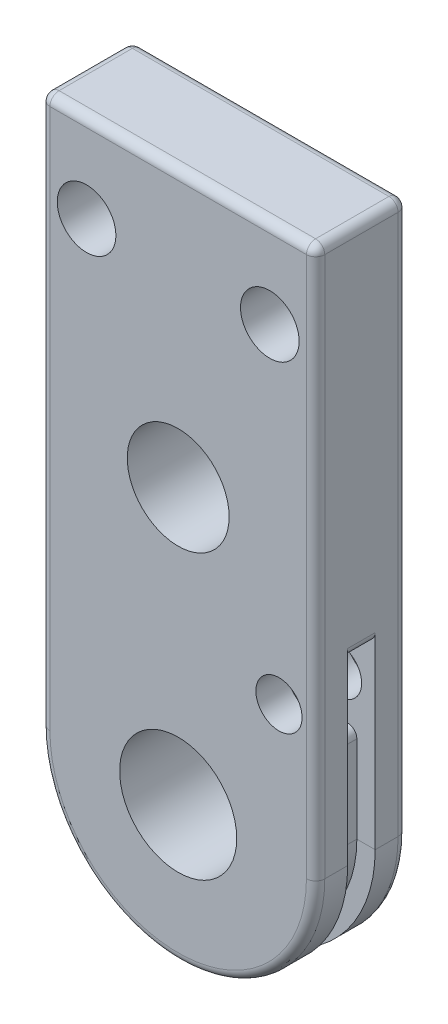
ISO-10303-21;
HEADER;
FILE_DESCRIPTION(('STEP AP214'),'2;1');
FILE_NAME('part.step','',(''),(''),'','','');
FILE_SCHEMA(('AUTOMOTIVE_DESIGN { 1 0 10303 214 1 1 1 1 }'));
ENDSEC;
DATA;
#1=APPLICATION_CONTEXT('core data for automotive mechanical design processes');
#2=APPLICATION_PROTOCOL_DEFINITION('international standard','automotive_design',2000,#1);
#3=PRODUCT_CONTEXT('',#1,'mechanical');
#4=PRODUCT('Part','Part','',(#3));
#5=PRODUCT_RELATED_PRODUCT_CATEGORY('part','',(#4));
#6=PRODUCT_DEFINITION_FORMATION('','',#4);
#7=PRODUCT_DEFINITION_CONTEXT('part definition',#1,'design');
#8=PRODUCT_DEFINITION('design','',#6,#7);
#9=PRODUCT_DEFINITION_SHAPE('','',#8);
#10=(LENGTH_UNIT() NAMED_UNIT(*) SI_UNIT(.MILLI.,.METRE.));
#11=(NAMED_UNIT(*) PLANE_ANGLE_UNIT() SI_UNIT($,.RADIAN.));
#12=(NAMED_UNIT(*) SI_UNIT($,.STERADIAN.) SOLID_ANGLE_UNIT());
#13=UNCERTAINTY_MEASURE_WITH_UNIT(LENGTH_MEASURE(1.E-05),#10,'distance_accuracy_value','');
#14=(GEOMETRIC_REPRESENTATION_CONTEXT(3) GLOBAL_UNCERTAINTY_ASSIGNED_CONTEXT((#13)) GLOBAL_UNIT_ASSIGNED_CONTEXT((#10,
#11,#12)) REPRESENTATION_CONTEXT('',''));
#15=CARTESIAN_POINT('',(0.,0.,0.));
#16=DIRECTION('',(0.,0.,1.));
#17=DIRECTION('',(1.,0.,0.));
#18=AXIS2_PLACEMENT_3D('',#15,#16,#17);
#19=CARTESIAN_POINT('',(0.,0.,3.175));
#20=DIRECTION('',(0.,0.,-1.));
#21=DIRECTION('',(-1.,0.,0.));
#22=AXIS2_PLACEMENT_3D('',#19,#20,#21);
#23=CYLINDRICAL_SURFACE('',#22,9.52500000000001);
#24=DIRECTION('',(0.,0.,-1.));
#25=VECTOR('',#24,1.);
#26=CARTESIAN_POINT('',(9.52500000000002,0.,3.175));
#27=LINE('',#26,#25);
#28=CARTESIAN_POINT('',(9.52500000000002,0.,2.54));
#29=VERTEX_POINT('',#28);
#30=CARTESIAN_POINT('',(9.52500000000001,0.,0.9525));
#31=VERTEX_POINT('',#30);
#32=EDGE_CURVE('E324',#29,#31,#27,.T.);
#33=ORIENTED_EDGE('',*,*,#32,.F.);
#34=CARTESIAN_POINT('',(0.,0.,2.54));
#35=DIRECTION('',(0.,0.,1.));
#36=DIRECTION('',(1.,0.,0.));
#37=AXIS2_PLACEMENT_3D('',#34,#35,#36);
#38=CIRCLE('',#37,9.52500000000001);
#39=CARTESIAN_POINT('',(-9.525,0.,2.54));
#40=VERTEX_POINT('',#39);
#41=EDGE_CURVE('E368',#29,#40,#38,.F.);
#42=ORIENTED_EDGE('',*,*,#41,.T.);
#43=DIRECTION('',(0.,0.,-1.));
#44=VECTOR('',#43,1.);
#45=CARTESIAN_POINT('',(-9.525,0.,3.175));
#46=LINE('',#45,#44);
#47=CARTESIAN_POINT('',(-9.52500000000001,0.,0.9525));
#48=VERTEX_POINT('',#47);
#49=EDGE_CURVE('E321',#40,#48,#46,.T.);
#50=ORIENTED_EDGE('',*,*,#49,.T.);
#51=CARTESIAN_POINT('',(0.,0.,0.9525));
#52=DIRECTION('',(0.,0.,1.));
#53=DIRECTION('',(-1.,0.,0.));
#54=AXIS2_PLACEMENT_3D('',#51,#52,#53);
#55=CIRCLE('',#54,9.52500000000001);
#56=EDGE_CURVE('E251',#48,#31,#55,.T.);
#57=ORIENTED_EDGE('',*,*,#56,.T.);
#58=EDGE_LOOP('',(#33,#42,#50,#57));
#59=FACE_BOUND('',#58,.T.);
#60=ADVANCED_FACE('F40',(#59),#23,.T.);
#61=CARTESIAN_POINT('',(9.52500000000002,0.,3.175));
#62=DIRECTION('',(1.,0.,0.));
#63=DIRECTION('',(0.,1.,0.));
#64=AXIS2_PLACEMENT_3D('',#61,#62,#63);
#65=PLANE('',#64);
#66=DIRECTION('',(0.,-1.,0.));
#67=VECTOR('',#66,1.);
#68=CARTESIAN_POINT('',(9.52500000000002,0.,0.9525));
#69=LINE('',#68,#67);
#70=CARTESIAN_POINT('',(9.52500000000001,13.0302,0.9525));
#71=VERTEX_POINT('',#70);
#72=EDGE_CURVE('E262',#71,#31,#69,.T.);
#73=ORIENTED_EDGE('',*,*,#72,.F.);
#74=DIRECTION('',(0.,0.,1.));
#75=VECTOR('',#74,1.);
#76=CARTESIAN_POINT('',(9.52500000000001,13.0302,3.175));
#77=LINE('',#76,#75);
#78=CARTESIAN_POINT('',(9.52500000000001,13.0302,-0.9525));
#79=VERTEX_POINT('',#78);
#80=EDGE_CURVE('E427',#71,#79,#77,.F.);
#81=ORIENTED_EDGE('',*,*,#80,.T.);
#82=DIRECTION('',(0.,-1.,0.));
#83=VECTOR('',#82,1.);
#84=CARTESIAN_POINT('',(9.52500000000002,0.,-0.9525));
#85=LINE('',#84,#83);
#86=CARTESIAN_POINT('',(9.52500000000001,0.,-0.952500000000001));
#87=VERTEX_POINT('',#86);
#88=EDGE_CURVE('E271',#79,#87,#85,.T.);
#89=ORIENTED_EDGE('',*,*,#88,.T.);
#90=CARTESIAN_POINT('',(9.52500000000002,0.,-2.54));
#91=VERTEX_POINT('',#90);
#92=EDGE_CURVE('E323',#87,#91,#27,.T.);
#93=ORIENTED_EDGE('',*,*,#92,.T.);
#94=DIRECTION('',(0.,-1.,0.));
#95=VECTOR('',#94,1.);
#96=CARTESIAN_POINT('',(9.52499999999999,38.1,-2.54));
#97=LINE('',#96,#95);
#98=CARTESIAN_POINT('',(9.52499999999999,37.465,-2.54));
#99=VERTEX_POINT('',#98);
#100=EDGE_CURVE('E357',#91,#99,#97,.F.);
#101=ORIENTED_EDGE('',*,*,#100,.T.);
#102=DIRECTION('',(0.,0.,-1.));
#103=VECTOR('',#102,1.);
#104=CARTESIAN_POINT('',(9.52499999999999,37.465,3.175));
#105=LINE('',#104,#103);
#106=CARTESIAN_POINT('',(9.52499999999999,37.465,2.54));
#107=VERTEX_POINT('',#106);
#108=EDGE_CURVE('E355',#99,#107,#105,.F.);
#109=ORIENTED_EDGE('',*,*,#108,.T.);
#110=DIRECTION('',(0.,-1.,0.));
#111=VECTOR('',#110,1.);
#112=CARTESIAN_POINT('',(9.52500000000002,0.,2.54));
#113=LINE('',#112,#111);
#114=EDGE_CURVE('E353',#107,#29,#113,.T.);
#115=ORIENTED_EDGE('',*,*,#114,.T.);
#116=ORIENTED_EDGE('',*,*,#32,.T.);
#117=EDGE_LOOP('',(#73,#81,#89,#93,#101,#109,#115,#116));
#118=FACE_BOUND('',#117,.T.);
#119=ADVANCED_FACE('F482',(#118),#65,.T.);
#120=CARTESIAN_POINT('',(6.98500000000001,9.525,3.175));
#121=DIRECTION('',(0.,0.,-1.));
#122=DIRECTION('',(-1.,0.,0.));
#123=AXIS2_PLACEMENT_3D('',#120,#121,#122);
#124=CYLINDRICAL_SURFACE('',#123,1.6002);
#125=CARTESIAN_POINT('',(6.98500000000001,9.525,-3.175));
#126=DIRECTION('',(0.,0.,1.));
#127=DIRECTION('',(1.,0.,0.));
#128=AXIS2_PLACEMENT_3D('',#125,#126,#127);
#129=CIRCLE('',#128,1.6002);
#130=CARTESIAN_POINT('',(8.58520000000001,9.525,-3.175));
#131=VERTEX_POINT('',#130);
#132=EDGE_CURVE('E295',#131,#131,#129,.T.);
#133=ORIENTED_EDGE('',*,*,#132,.F.);
#134=EDGE_LOOP('',(#133));
#135=FACE_BOUND('',#134,.T.);
#136=CARTESIAN_POINT('',(6.98500000000001,9.525,-0.9525));
#137=DIRECTION('',(0.,0.,1.));
#138=DIRECTION('',(1.,0.,0.));
#139=AXIS2_PLACEMENT_3D('',#136,#137,#138);
#140=CIRCLE('',#139,1.6002);
#141=CARTESIAN_POINT('',(8.58520000000001,9.525,-0.9525));
#142=VERTEX_POINT('',#141);
#143=EDGE_CURVE('E258',#142,#142,#140,.T.);
#144=ORIENTED_EDGE('',*,*,#143,.T.);
#145=EDGE_LOOP('',(#144));
#146=FACE_BOUND('',#145,.T.);
#147=ADVANCED_FACE('F548',(#135,#146),#124,.F.);
#148=CARTESIAN_POINT('',(-9.52500000000001,0.,-0.9525));
#149=VERTEX_POINT('',#148);
#150=CARTESIAN_POINT('',(-9.525,0.,-2.54));
#151=VERTEX_POINT('',#150);
#152=EDGE_CURVE('E307',#149,#151,#46,.T.);
#153=ORIENTED_EDGE('',*,*,#152,.T.);
#154=CARTESIAN_POINT('',(0.,0.,-2.54));
#155=DIRECTION('',(0.,0.,1.));
#156=DIRECTION('',(1.,0.,0.));
#157=AXIS2_PLACEMENT_3D('',#154,#155,#156);
#158=CIRCLE('',#157,9.52500000000001);
#159=EDGE_CURVE('E342',#151,#91,#158,.T.);
#160=ORIENTED_EDGE('',*,*,#159,.T.);
#161=ORIENTED_EDGE('',*,*,#92,.F.);
#162=CARTESIAN_POINT('',(0.,0.,-0.9525));
#163=DIRECTION('',(0.,0.,1.));
#164=DIRECTION('',(-1.,0.,0.));
#165=AXIS2_PLACEMENT_3D('',#162,#163,#164);
#166=CIRCLE('',#165,9.52500000000001);
#167=EDGE_CURVE('E254',#149,#87,#166,.T.);
#168=ORIENTED_EDGE('',*,*,#167,.F.);
#169=EDGE_LOOP('',(#153,#160,#161,#168));
#170=FACE_BOUND('',#169,.T.);
#171=ADVANCED_FACE('F476',(#170),#23,.T.);
#172=CARTESIAN_POINT('',(0.,38.1,3.175));
#173=DIRECTION('',(0.,1.,0.));
#174=DIRECTION('',(-1.,0.,0.));
#175=AXIS2_PLACEMENT_3D('',#172,#173,#174);
#176=PLANE('',#175);
#177=DIRECTION('',(1.,0.,0.));
#178=VECTOR('',#177,1.);
#179=CARTESIAN_POINT('',(0.,38.1,2.54));
#180=LINE('',#179,#178);
#181=CARTESIAN_POINT('',(-8.89,38.1,2.54));
#182=VERTEX_POINT('',#181);
#183=CARTESIAN_POINT('',(8.88999999999999,38.1,2.54));
#184=VERTEX_POINT('',#183);
#185=EDGE_CURVE('E348',#182,#184,#180,.T.);
#186=ORIENTED_EDGE('',*,*,#185,.T.);
#187=DIRECTION('',(0.,0.,-1.));
#188=VECTOR('',#187,1.);
#189=CARTESIAN_POINT('',(8.88999999999999,38.1,3.175));
#190=LINE('',#189,#188);
#191=CARTESIAN_POINT('',(8.88999999999999,38.1,-2.54));
#192=VERTEX_POINT('',#191);
#193=EDGE_CURVE('E350',#184,#192,#190,.T.);
#194=ORIENTED_EDGE('',*,*,#193,.T.);
#195=DIRECTION('',(1.,0.,0.));
#196=VECTOR('',#195,1.);
#197=CARTESIAN_POINT('',(-9.525,38.1,-2.54));
#198=LINE('',#197,#196);
#199=CARTESIAN_POINT('',(-8.89,38.1,-2.54));
#200=VERTEX_POINT('',#199);
#201=EDGE_CURVE('E344',#192,#200,#198,.F.);
#202=ORIENTED_EDGE('',*,*,#201,.T.);
#203=DIRECTION('',(0.,0.,-1.));
#204=VECTOR('',#203,1.);
#205=CARTESIAN_POINT('',(-8.89,38.1,3.175));
#206=LINE('',#205,#204);
#207=EDGE_CURVE('E346',#200,#182,#206,.F.);
#208=ORIENTED_EDGE('',*,*,#207,.T.);
#209=EDGE_LOOP('',(#186,#194,#202,#208));
#210=FACE_BOUND('',#209,.T.);
#211=ADVANCED_FACE('F509',(#210),#176,.T.);
#212=CARTESIAN_POINT('',(0.,0.,3.175));
#213=DIRECTION('',(0.,0.,-1.));
#214=DIRECTION('',(-1.,0.,0.));
#215=AXIS2_PLACEMENT_3D('',#212,#213,#214);
#216=CYLINDRICAL_SURFACE('',#215,4.05765);
#217=CARTESIAN_POINT('',(0.,0.,3.175));
#218=DIRECTION('',(0.,0.,1.));
#219=DIRECTION('',(1.,0.,0.));
#220=AXIS2_PLACEMENT_3D('',#217,#218,#219);
#221=CIRCLE('',#220,4.05765);
#222=CARTESIAN_POINT('',(4.05765,0.,3.175));
#223=VERTEX_POINT('',#222);
#224=EDGE_CURVE('E301',#223,#223,#221,.T.);
#225=ORIENTED_EDGE('',*,*,#224,.T.);
#226=EDGE_LOOP('',(#225));
#227=FACE_BOUND('',#226,.T.);
#228=CARTESIAN_POINT('',(0.,0.,-3.175));
#229=DIRECTION('',(0.,0.,1.));
#230=DIRECTION('',(1.,0.,0.));
#231=AXIS2_PLACEMENT_3D('',#228,#229,#230);
#232=CIRCLE('',#231,4.05765);
#233=CARTESIAN_POINT('',(4.05765,0.,-3.175));
#234=VERTEX_POINT('',#233);
#235=EDGE_CURVE('E316',#234,#234,#232,.T.);
#236=ORIENTED_EDGE('',*,*,#235,.F.);
#237=EDGE_LOOP('',(#236));
#238=FACE_BOUND('',#237,.T.);
#239=ADVANCED_FACE('F556',(#227,#238),#216,.F.);
#240=CARTESIAN_POINT('',(0.,19.05,3.175));
#241=DIRECTION('',(0.,0.,-1.));
#242=DIRECTION('',(-1.,0.,0.));
#243=AXIS2_PLACEMENT_3D('',#240,#241,#242);
#244=CYLINDRICAL_SURFACE('',#243,3.5306);
#245=CARTESIAN_POINT('',(0.,19.05,3.175));
#246=DIRECTION('',(0.,0.,1.));
#247=DIRECTION('',(1.,0.,0.));
#248=AXIS2_PLACEMENT_3D('',#245,#246,#247);
#249=CIRCLE('',#248,3.5306);
#250=CARTESIAN_POINT('',(3.5306,19.05,3.175));
#251=VERTEX_POINT('',#250);
#252=EDGE_CURVE('E298',#251,#251,#249,.T.);
#253=ORIENTED_EDGE('',*,*,#252,.T.);
#254=EDGE_LOOP('',(#253));
#255=FACE_BOUND('',#254,.T.);
#256=CARTESIAN_POINT('',(0.,19.05,-3.175));
#257=DIRECTION('',(0.,0.,1.));
#258=DIRECTION('',(1.,0.,0.));
#259=AXIS2_PLACEMENT_3D('',#256,#257,#258);
#260=CIRCLE('',#259,3.5306);
#261=CARTESIAN_POINT('',(3.5306,19.05,-3.175));
#262=VERTEX_POINT('',#261);
#263=EDGE_CURVE('E313',#262,#262,#260,.T.);
#264=ORIENTED_EDGE('',*,*,#263,.F.);
#265=EDGE_LOOP('',(#264));
#266=FACE_BOUND('',#265,.T.);
#267=ADVANCED_FACE('F743',(#255,#266),#244,.F.);
#268=CARTESIAN_POINT('',(6.35,32.004,3.175));
#269=DIRECTION('',(0.,0.,-1.));
#270=DIRECTION('',(-1.,0.,0.));
#271=AXIS2_PLACEMENT_3D('',#268,#269,#270);
#272=CYLINDRICAL_SURFACE('',#271,2.032);
#273=CARTESIAN_POINT('',(6.35,32.004,3.175));
#274=DIRECTION('',(0.,0.,1.));
#275=DIRECTION('',(1.,0.,0.));
#276=AXIS2_PLACEMENT_3D('',#273,#274,#275);
#277=CIRCLE('',#276,2.032);
#278=CARTESIAN_POINT('',(8.382,32.004,3.175));
#279=VERTEX_POINT('',#278);
#280=EDGE_CURVE('E294',#279,#279,#277,.T.);
#281=ORIENTED_EDGE('',*,*,#280,.T.);
#282=EDGE_LOOP('',(#281));
#283=FACE_BOUND('',#282,.T.);
#284=CARTESIAN_POINT('',(6.35,32.004,-3.175));
#285=DIRECTION('',(0.,0.,1.));
#286=DIRECTION('',(1.,0.,0.));
#287=AXIS2_PLACEMENT_3D('',#284,#285,#286);
#288=CIRCLE('',#287,2.032);
#289=CARTESIAN_POINT('',(8.382,32.004,-3.175));
#290=VERTEX_POINT('',#289);
#291=EDGE_CURVE('E310',#290,#290,#288,.T.);
#292=ORIENTED_EDGE('',*,*,#291,.F.);
#293=EDGE_LOOP('',(#292));
#294=FACE_BOUND('',#293,.T.);
#295=ADVANCED_FACE('F736',(#283,#294),#272,.F.);
#296=CARTESIAN_POINT('',(-6.35,32.004,3.175));
#297=DIRECTION('',(0.,0.,-1.));
#298=DIRECTION('',(-1.,0.,0.));
#299=AXIS2_PLACEMENT_3D('',#296,#297,#298);
#300=CYLINDRICAL_SURFACE('',#299,2.032);
#301=CARTESIAN_POINT('',(-6.35,32.004,3.175));
#302=DIRECTION('',(0.,0.,1.));
#303=DIRECTION('',(1.,0.,0.));
#304=AXIS2_PLACEMENT_3D('',#301,#302,#303);
#305=CIRCLE('',#304,2.032);
#306=CARTESIAN_POINT('',(-4.318,32.004,3.175));
#307=VERTEX_POINT('',#306);
#308=EDGE_CURVE('E291',#307,#307,#305,.T.);
#309=ORIENTED_EDGE('',*,*,#308,.T.);
#310=EDGE_LOOP('',(#309));
#311=FACE_BOUND('',#310,.T.);
#312=CARTESIAN_POINT('',(-6.35,32.004,-3.175));
#313=DIRECTION('',(0.,0.,1.));
#314=DIRECTION('',(1.,0.,0.));
#315=AXIS2_PLACEMENT_3D('',#312,#313,#314);
#316=CIRCLE('',#315,2.032);
#317=CARTESIAN_POINT('',(-4.318,32.004,-3.175));
#318=VERTEX_POINT('',#317);
#319=EDGE_CURVE('E289',#318,#318,#316,.T.);
#320=ORIENTED_EDGE('',*,*,#319,.F.);
#321=EDGE_LOOP('',(#320));
#322=FACE_BOUND('',#321,.T.);
#323=ADVANCED_FACE('F576',(#311,#322),#300,.F.);
#324=CARTESIAN_POINT('',(-9.525,0.,3.175));
#325=DIRECTION('',(-1.,0.,0.));
#326=DIRECTION('',(0.,0.,1.));
#327=AXIS2_PLACEMENT_3D('',#324,#325,#326);
#328=PLANE('',#327);
#329=DIRECTION('',(0.,-1.,0.));
#330=VECTOR('',#329,1.);
#331=CARTESIAN_POINT('',(-9.525,6.35,-0.9525));
#332=LINE('',#331,#330);
#333=CARTESIAN_POINT('',(-9.525,6.985,-0.9525));
#334=VERTEX_POINT('',#333);
#335=EDGE_CURVE('E56',#334,#149,#332,.T.);
#336=ORIENTED_EDGE('',*,*,#335,.F.);
#337=DIRECTION('',(0.,0.,-1.));
#338=VECTOR('',#337,1.);
#339=CARTESIAN_POINT('',(-9.525,6.985,0.9525));
#340=LINE('',#339,#338);
#341=CARTESIAN_POINT('',(-9.525,6.985,0.9525));
#342=VERTEX_POINT('',#341);
#343=EDGE_CURVE('E430',#334,#342,#340,.F.);
#344=ORIENTED_EDGE('',*,*,#343,.T.);
#345=DIRECTION('',(0.,-1.,0.));
#346=VECTOR('',#345,1.);
#347=CARTESIAN_POINT('',(-9.525,6.35,0.9525));
#348=LINE('',#347,#346);
#349=EDGE_CURVE('E63',#342,#48,#348,.T.);
#350=ORIENTED_EDGE('',*,*,#349,.T.);
#351=ORIENTED_EDGE('',*,*,#49,.F.);
#352=DIRECTION('',(0.,1.,0.));
#353=VECTOR('',#352,1.);
#354=CARTESIAN_POINT('',(-9.525,0.,2.54));
#355=LINE('',#354,#353);
#356=CARTESIAN_POINT('',(-9.525,37.465,2.54));
#357=VERTEX_POINT('',#356);
#358=EDGE_CURVE('E335',#40,#357,#355,.T.);
#359=ORIENTED_EDGE('',*,*,#358,.T.);
#360=DIRECTION('',(0.,0.,-1.));
#361=VECTOR('',#360,1.);
#362=CARTESIAN_POINT('',(-9.525,37.465,3.175));
#363=LINE('',#362,#361);
#364=CARTESIAN_POINT('',(-9.525,37.465,-2.54));
#365=VERTEX_POINT('',#364);
#366=EDGE_CURVE('E337',#357,#365,#363,.T.);
#367=ORIENTED_EDGE('',*,*,#366,.T.);
#368=DIRECTION('',(0.,1.,0.));
#369=VECTOR('',#368,1.);
#370=CARTESIAN_POINT('',(-9.525,0.,-2.54));
#371=LINE('',#370,#369);
#372=EDGE_CURVE('E339',#365,#151,#371,.F.);
#373=ORIENTED_EDGE('',*,*,#372,.T.);
#374=ORIENTED_EDGE('',*,*,#152,.F.);
#375=EDGE_LOOP('',(#336,#344,#350,#351,#359,#367,#373,#374));
#376=FACE_BOUND('',#375,.T.);
#377=ADVANCED_FACE('F448',(#376),#328,.T.);
#378=CARTESIAN_POINT('',(6.98500000000001,9.525,0.9525));
#379=DIRECTION('',(0.,0.,1.));
#380=DIRECTION('',(1.,0.,0.));
#381=AXIS2_PLACEMENT_3D('',#378,#379,#380);
#382=CIRCLE('',#381,1.6002);
#383=CARTESIAN_POINT('',(8.58520000000001,9.525,0.9525));
#384=VERTEX_POINT('',#383);
#385=EDGE_CURVE('E243',#384,#384,#382,.T.);
#386=ORIENTED_EDGE('',*,*,#385,.F.);
#387=EDGE_LOOP('',(#386));
#388=FACE_BOUND('',#387,.T.);
#389=CARTESIAN_POINT('',(6.98500000000001,9.525,3.175));
#390=DIRECTION('',(0.,0.,1.));
#391=DIRECTION('',(1.,0.,0.));
#392=AXIS2_PLACEMENT_3D('',#389,#390,#391);
#393=CIRCLE('',#392,1.6002);
#394=CARTESIAN_POINT('',(8.58520000000001,9.525,3.175));
#395=VERTEX_POINT('',#394);
#396=EDGE_CURVE('E304',#395,#395,#393,.T.);
#397=ORIENTED_EDGE('',*,*,#396,.T.);
#398=EDGE_LOOP('',(#397));
#399=FACE_BOUND('',#398,.T.);
#400=ADVANCED_FACE('F560',(#388,#399),#124,.F.);
#401=CARTESIAN_POINT('',(0.,0.,3.175));
#402=DIRECTION('',(0.,0.,1.));
#403=DIRECTION('',(1.,0.,0.));
#404=AXIS2_PLACEMENT_3D('',#401,#402,#403);
#405=PLANE('',#404);
#406=DIRECTION('',(1.,0.,0.));
#407=VECTOR('',#406,1.);
#408=CARTESIAN_POINT('',(0.,37.465,3.175));
#409=LINE('',#408,#407);
#410=CARTESIAN_POINT('',(8.88999999999999,37.465,3.175));
#411=VERTEX_POINT('',#410);
#412=CARTESIAN_POINT('',(-8.89,37.465,3.175));
#413=VERTEX_POINT('',#412);
#414=EDGE_CURVE('E363',#411,#413,#409,.F.);
#415=ORIENTED_EDGE('',*,*,#414,.T.);
#416=DIRECTION('',(0.,1.,0.));
#417=VECTOR('',#416,1.);
#418=CARTESIAN_POINT('',(-8.89,0.,3.175));
#419=LINE('',#418,#417);
#420=CARTESIAN_POINT('',(-8.89000000000001,0.,3.175));
#421=VERTEX_POINT('',#420);
#422=EDGE_CURVE('E366',#413,#421,#419,.F.);
#423=ORIENTED_EDGE('',*,*,#422,.T.);
#424=CARTESIAN_POINT('',(0.,0.,3.175));
#425=DIRECTION('',(0.,0.,1.));
#426=DIRECTION('',(1.,0.,0.));
#427=AXIS2_PLACEMENT_3D('',#424,#425,#426);
#428=CIRCLE('',#427,8.89000000000001);
#429=CARTESIAN_POINT('',(8.89000000000002,0.,3.175));
#430=VERTEX_POINT('',#429);
#431=EDGE_CURVE('E361',#421,#430,#428,.T.);
#432=ORIENTED_EDGE('',*,*,#431,.T.);
#433=DIRECTION('',(0.,-1.,0.));
#434=VECTOR('',#433,1.);
#435=CARTESIAN_POINT('',(8.89000000000002,0.,3.175));
#436=LINE('',#435,#434);
#437=EDGE_CURVE('E359',#430,#411,#436,.F.);
#438=ORIENTED_EDGE('',*,*,#437,.T.);
#439=EDGE_LOOP('',(#415,#423,#432,#438));
#440=FACE_BOUND('',#439,.T.);
#441=ORIENTED_EDGE('',*,*,#308,.F.);
#442=EDGE_LOOP('',(#441));
#443=FACE_BOUND('',#442,.T.);
#444=ORIENTED_EDGE('',*,*,#280,.F.);
#445=EDGE_LOOP('',(#444));
#446=FACE_BOUND('',#445,.T.);
#447=ORIENTED_EDGE('',*,*,#252,.F.);
#448=EDGE_LOOP('',(#447));
#449=FACE_BOUND('',#448,.T.);
#450=ORIENTED_EDGE('',*,*,#224,.F.);
#451=EDGE_LOOP('',(#450));
#452=FACE_BOUND('',#451,.T.);
#453=ORIENTED_EDGE('',*,*,#396,.F.);
#454=EDGE_LOOP('',(#453));
#455=FACE_BOUND('',#454,.T.);
#456=ADVANCED_FACE('F568',(#440,#443,#446,#449,#452,#455),#405,.T.);
#457=CARTESIAN_POINT('',(0.,0.,-3.175));
#458=DIRECTION('',(0.,0.,1.));
#459=DIRECTION('',(1.,0.,0.));
#460=AXIS2_PLACEMENT_3D('',#457,#458,#459);
#461=PLANE('',#460);
#462=CARTESIAN_POINT('',(0.,0.,-3.175));
#463=DIRECTION('',(0.,0.,1.));
#464=DIRECTION('',(1.,0.,0.));
#465=AXIS2_PLACEMENT_3D('',#462,#463,#464);
#466=CIRCLE('',#465,8.89000000000001);
#467=CARTESIAN_POINT('',(8.89000000000002,0.,-3.175));
#468=VERTEX_POINT('',#467);
#469=CARTESIAN_POINT('',(-8.89000000000001,0.,-3.175));
#470=VERTEX_POINT('',#469);
#471=EDGE_CURVE('E330',#468,#470,#466,.F.);
#472=ORIENTED_EDGE('',*,*,#471,.T.);
#473=DIRECTION('',(0.,1.,0.));
#474=VECTOR('',#473,1.);
#475=CARTESIAN_POINT('',(-8.89,38.1,-3.175));
#476=LINE('',#475,#474);
#477=CARTESIAN_POINT('',(-8.89,37.465,-3.175));
#478=VERTEX_POINT('',#477);
#479=EDGE_CURVE('E332',#470,#478,#476,.T.);
#480=ORIENTED_EDGE('',*,*,#479,.T.);
#481=DIRECTION('',(1.,0.,0.));
#482=VECTOR('',#481,1.);
#483=CARTESIAN_POINT('',(9.52499999999999,37.465,-3.175));
#484=LINE('',#483,#482);
#485=CARTESIAN_POINT('',(8.88999999999999,37.465,-3.175));
#486=VERTEX_POINT('',#485);
#487=EDGE_CURVE('E328',#478,#486,#484,.T.);
#488=ORIENTED_EDGE('',*,*,#487,.T.);
#489=DIRECTION('',(0.,-1.,0.));
#490=VECTOR('',#489,1.);
#491=CARTESIAN_POINT('',(8.89000000000002,0.,-3.175));
#492=LINE('',#491,#490);
#493=EDGE_CURVE('E326',#486,#468,#492,.T.);
#494=ORIENTED_EDGE('',*,*,#493,.T.);
#495=EDGE_LOOP('',(#472,#480,#488,#494));
#496=FACE_BOUND('',#495,.T.);
#497=ORIENTED_EDGE('',*,*,#319,.T.);
#498=EDGE_LOOP('',(#497));
#499=FACE_BOUND('',#498,.T.);
#500=ORIENTED_EDGE('',*,*,#291,.T.);
#501=EDGE_LOOP('',(#500));
#502=FACE_BOUND('',#501,.T.);
#503=ORIENTED_EDGE('',*,*,#263,.T.);
#504=EDGE_LOOP('',(#503));
#505=FACE_BOUND('',#504,.T.);
#506=ORIENTED_EDGE('',*,*,#235,.T.);
#507=EDGE_LOOP('',(#506));
#508=FACE_BOUND('',#507,.T.);
#509=ORIENTED_EDGE('',*,*,#132,.T.);
#510=EDGE_LOOP('',(#509));
#511=FACE_BOUND('',#510,.T.);
#512=ADVANCED_FACE('F495',(#496,#499,#502,#505,#508,#511),#461,.F.);
#513=CARTESIAN_POINT('',(0.,12.3952,-0.9525));
#514=DIRECTION('',(0.,-1.,0.));
#515=DIRECTION('',(0.,0.,-1.));
#516=AXIS2_PLACEMENT_3D('',#513,#514,#515);
#517=PLANE('',#516);
#518=DIRECTION('',(1.,0.,0.));
#519=VECTOR('',#518,1.);
#520=CARTESIAN_POINT('',(0.,12.3952,-0.9525));
#521=LINE('',#520,#519);
#522=CARTESIAN_POINT('',(6.98500000000001,12.3952,-0.9525));
#523=VERTEX_POINT('',#522);
#524=CARTESIAN_POINT('',(8.89000000000001,12.3952,-0.9525));
#525=VERTEX_POINT('',#524);
#526=EDGE_CURVE('E261',#523,#525,#521,.T.);
#527=ORIENTED_EDGE('',*,*,#526,.T.);
#528=DIRECTION('',(0.,0.,1.));
#529=VECTOR('',#528,1.);
#530=CARTESIAN_POINT('',(8.89000000000001,12.3952,-0.9525));
#531=LINE('',#530,#529);
#532=CARTESIAN_POINT('',(8.89000000000001,12.3952,0.9525));
#533=VERTEX_POINT('',#532);
#534=EDGE_CURVE('E424',#525,#533,#531,.T.);
#535=ORIENTED_EDGE('',*,*,#534,.T.);
#536=DIRECTION('',(1.,0.,0.));
#537=VECTOR('',#536,1.);
#538=CARTESIAN_POINT('',(0.,12.3952,0.9525));
#539=LINE('',#538,#537);
#540=CARTESIAN_POINT('',(6.98500000000001,12.3952,0.9525));
#541=VERTEX_POINT('',#540);
#542=EDGE_CURVE('E276',#541,#533,#539,.T.);
#543=ORIENTED_EDGE('',*,*,#542,.F.);
#544=DIRECTION('',(0.,0.,1.));
#545=VECTOR('',#544,1.);
#546=CARTESIAN_POINT('',(6.98500000000001,12.3952,-0.9525));
#547=LINE('',#546,#545);
#548=EDGE_CURVE('E273',#523,#541,#547,.T.);
#549=ORIENTED_EDGE('',*,*,#548,.F.);
#550=EDGE_LOOP('',(#527,#535,#543,#549));
#551=FACE_BOUND('',#550,.T.);
#552=ADVANCED_FACE('F594',(#551),#517,.T.);
#553=CARTESIAN_POINT('',(0.,6.6548,-0.9525));
#554=DIRECTION('',(0.,-1.,0.));
#555=DIRECTION('',(0.,0.,-1.));
#556=AXIS2_PLACEMENT_3D('',#553,#554,#555);
#557=PLANE('',#556);
#558=DIRECTION('',(1.,0.,0.));
#559=VECTOR('',#558,1.);
#560=CARTESIAN_POINT('',(0.,6.6548,0.9525));
#561=LINE('',#560,#559);
#562=CARTESIAN_POINT('',(6.98500000000001,6.6548,0.9525));
#563=VERTEX_POINT('',#562);
#564=CARTESIAN_POINT('',(7.62000000000001,6.6548,0.9525));
#565=VERTEX_POINT('',#564);
#566=EDGE_CURVE('E282',#563,#565,#561,.T.);
#567=ORIENTED_EDGE('',*,*,#566,.T.);
#568=DIRECTION('',(0.,0.,1.));
#569=VECTOR('',#568,1.);
#570=CARTESIAN_POINT('',(7.62000000000001,6.6548,-0.9525));
#571=LINE('',#570,#569);
#572=CARTESIAN_POINT('',(7.62000000000001,6.6548,-0.9525));
#573=VERTEX_POINT('',#572);
#574=EDGE_CURVE('E422',#565,#573,#571,.F.);
#575=ORIENTED_EDGE('',*,*,#574,.T.);
#576=DIRECTION('',(1.,0.,0.));
#577=VECTOR('',#576,1.);
#578=CARTESIAN_POINT('',(0.,6.6548,-0.9525));
#579=LINE('',#578,#577);
#580=CARTESIAN_POINT('',(6.98500000000001,6.6548,-0.9525));
#581=VERTEX_POINT('',#580);
#582=EDGE_CURVE('E268',#581,#573,#579,.T.);
#583=ORIENTED_EDGE('',*,*,#582,.F.);
#584=DIRECTION('',(0.,0.,1.));
#585=VECTOR('',#584,1.);
#586=CARTESIAN_POINT('',(6.98500000000001,6.6548,-0.9525));
#587=LINE('',#586,#585);
#588=EDGE_CURVE('E287',#581,#563,#587,.T.);
#589=ORIENTED_EDGE('',*,*,#588,.T.);
#590=EDGE_LOOP('',(#567,#575,#583,#589));
#591=FACE_BOUND('',#590,.T.);
#592=ADVANCED_FACE('F604',(#591),#557,.F.);
#593=CARTESIAN_POINT('',(6.98500000000001,9.525,-0.9525));
#594=DIRECTION('',(0.,0.,1.));
#595=DIRECTION('',(1.,0.,0.));
#596=AXIS2_PLACEMENT_3D('',#593,#594,#595);
#597=CYLINDRICAL_SURFACE('',#596,2.8702);
#598=CARTESIAN_POINT('',(6.98500000000001,9.525,0.9525));
#599=DIRECTION('',(0.,0.,1.));
#600=DIRECTION('',(1.,0.,0.));
#601=AXIS2_PLACEMENT_3D('',#598,#599,#600);
#602=CIRCLE('',#601,2.8702);
#603=EDGE_CURVE('E279',#541,#563,#602,.T.);
#604=ORIENTED_EDGE('',*,*,#603,.T.);
#605=ORIENTED_EDGE('',*,*,#588,.F.);
#606=CARTESIAN_POINT('',(6.98500000000001,9.525,-0.9525));
#607=DIRECTION('',(0.,0.,1.));
#608=DIRECTION('',(1.,0.,0.));
#609=AXIS2_PLACEMENT_3D('',#606,#607,#608);
#610=CIRCLE('',#609,2.8702);
#611=EDGE_CURVE('E265',#523,#581,#610,.T.);
#612=ORIENTED_EDGE('',*,*,#611,.F.);
#613=ORIENTED_EDGE('',*,*,#548,.T.);
#614=EDGE_LOOP('',(#604,#605,#612,#613));
#615=FACE_BOUND('',#614,.T.);
#616=ADVANCED_FACE('F608',(#615),#597,.F.);
#617=CARTESIAN_POINT('',(0.,0.,-0.9525));
#618=DIRECTION('',(0.,0.,1.));
#619=DIRECTION('',(1.,0.,0.));
#620=AXIS2_PLACEMENT_3D('',#617,#618,#619);
#621=PLANE('',#620);
#622=ORIENTED_EDGE('',*,*,#143,.F.);
#623=EDGE_LOOP('',(#622));
#624=FACE_BOUND('',#623,.T.);
#625=ORIENTED_EDGE('',*,*,#526,.F.);
#626=ORIENTED_EDGE('',*,*,#611,.T.);
#627=ORIENTED_EDGE('',*,*,#582,.T.);
#628=CARTESIAN_POINT('',(7.62000000000001,6.0198,-0.9525));
#629=DIRECTION('',(0.,0.,1.));
#630=DIRECTION('',(1.,0.,0.));
#631=AXIS2_PLACEMENT_3D('',#628,#629,#630);
#632=CIRCLE('',#631,0.635);
#633=CARTESIAN_POINT('',(8.25500000000001,6.0198,-0.9525));
#634=VERTEX_POINT('',#633);
#635=EDGE_CURVE('E434',#573,#634,#632,.F.);
#636=ORIENTED_EDGE('',*,*,#635,.T.);
#637=DIRECTION('',(0.,1.,0.));
#638=VECTOR('',#637,1.);
#639=CARTESIAN_POINT('',(8.25500000000001,0.,-0.9525));
#640=LINE('',#639,#638);
#641=CARTESIAN_POINT('',(8.25500000000001,0.,-0.952499999999999));
#642=VERTEX_POINT('',#641);
#643=EDGE_CURVE('E244',#642,#634,#640,.T.);
#644=ORIENTED_EDGE('',*,*,#643,.F.);
#645=DIRECTION('',(-1.,0.,0.));
#646=VECTOR('',#645,1.);
#647=CARTESIAN_POINT('',(9.52500000000001,0.,-0.9525));
#648=LINE('',#647,#646);
#649=EDGE_CURVE('E218',#87,#642,#648,.T.);
#650=ORIENTED_EDGE('',*,*,#649,.F.);
#651=ORIENTED_EDGE('',*,*,#88,.F.);
#652=CARTESIAN_POINT('',(8.89000000000001,13.0302,-0.9525));
#653=DIRECTION('',(0.,0.,1.));
#654=DIRECTION('',(1.,0.,0.));
#655=AXIS2_PLACEMENT_3D('',#652,#653,#654);
#656=CIRCLE('',#655,0.635);
#657=EDGE_CURVE('E439',#79,#525,#656,.F.);
#658=ORIENTED_EDGE('',*,*,#657,.T.);
#659=EDGE_LOOP('',(#625,#626,#627,#636,#644,#650,#651,#658));
#660=FACE_BOUND('',#659,.T.);
#661=ADVANCED_FACE('F586',(#624,#660),#621,.T.);
#662=CARTESIAN_POINT('',(0.,0.,0.9525));
#663=DIRECTION('',(0.,0.,1.));
#664=DIRECTION('',(1.,0.,0.));
#665=AXIS2_PLACEMENT_3D('',#662,#663,#664);
#666=PLANE('',#665);
#667=ORIENTED_EDGE('',*,*,#385,.T.);
#668=EDGE_LOOP('',(#667));
#669=FACE_BOUND('',#668,.T.);
#670=ORIENTED_EDGE('',*,*,#542,.T.);
#671=CARTESIAN_POINT('',(8.89000000000001,13.0302,0.9525));
#672=DIRECTION('',(0.,0.,1.));
#673=DIRECTION('',(1.,0.,0.));
#674=AXIS2_PLACEMENT_3D('',#671,#672,#673);
#675=CIRCLE('',#674,0.635);
#676=EDGE_CURVE('E436',#533,#71,#675,.T.);
#677=ORIENTED_EDGE('',*,*,#676,.T.);
#678=ORIENTED_EDGE('',*,*,#72,.T.);
#679=DIRECTION('',(1.,0.,0.));
#680=VECTOR('',#679,1.);
#681=CARTESIAN_POINT('',(9.52500000000001,0.,0.9525));
#682=LINE('',#681,#680);
#683=CARTESIAN_POINT('',(8.25500000000001,0.,0.9525));
#684=VERTEX_POINT('',#683);
#685=EDGE_CURVE('E238',#684,#31,#682,.T.);
#686=ORIENTED_EDGE('',*,*,#685,.F.);
#687=DIRECTION('',(0.,1.,0.));
#688=VECTOR('',#687,1.);
#689=CARTESIAN_POINT('',(8.25500000000001,0.,0.9525));
#690=LINE('',#689,#688);
#691=CARTESIAN_POINT('',(8.25500000000001,6.0198,0.9525));
#692=VERTEX_POINT('',#691);
#693=EDGE_CURVE('E240',#684,#692,#690,.T.);
#694=ORIENTED_EDGE('',*,*,#693,.T.);
#695=CARTESIAN_POINT('',(7.62000000000001,6.0198,0.9525));
#696=DIRECTION('',(0.,0.,1.));
#697=DIRECTION('',(1.,0.,0.));
#698=AXIS2_PLACEMENT_3D('',#695,#696,#697);
#699=CIRCLE('',#698,0.635);
#700=EDGE_CURVE('E432',#692,#565,#699,.T.);
#701=ORIENTED_EDGE('',*,*,#700,.T.);
#702=ORIENTED_EDGE('',*,*,#566,.F.);
#703=ORIENTED_EDGE('',*,*,#603,.F.);
#704=EDGE_LOOP('',(#670,#677,#678,#686,#694,#701,#702,#703));
#705=FACE_BOUND('',#704,.T.);
#706=ADVANCED_FACE('F583',(#669,#705),#666,.F.);
#707=CARTESIAN_POINT('',(-8.255,6.35,-0.9525));
#708=DIRECTION('',(1.,0.,0.));
#709=DIRECTION('',(0.,1.,0.));
#710=AXIS2_PLACEMENT_3D('',#707,#708,#709);
#711=PLANE('',#710);
#712=DIRECTION('',(0.,-1.,0.));
#713=VECTOR('',#712,1.);
#714=CARTESIAN_POINT('',(-8.255,6.35,0.9525));
#715=LINE('',#714,#713);
#716=CARTESIAN_POINT('',(-8.255,5.715,0.9525));
#717=VERTEX_POINT('',#716);
#718=CARTESIAN_POINT('',(-8.25500000000001,0.,0.9525));
#719=VERTEX_POINT('',#718);
#720=EDGE_CURVE('E232',#717,#719,#715,.T.);
#721=ORIENTED_EDGE('',*,*,#720,.F.);
#722=DIRECTION('',(0.,0.,1.));
#723=VECTOR('',#722,1.);
#724=CARTESIAN_POINT('',(-8.255,5.715,-0.9525));
#725=LINE('',#724,#723);
#726=CARTESIAN_POINT('',(-8.255,5.715,-0.9525));
#727=VERTEX_POINT('',#726);
#728=EDGE_CURVE('E205',#717,#727,#725,.F.);
#729=ORIENTED_EDGE('',*,*,#728,.T.);
#730=DIRECTION('',(0.,-1.,0.));
#731=VECTOR('',#730,1.);
#732=CARTESIAN_POINT('',(-8.255,6.35,-0.9525));
#733=LINE('',#732,#731);
#734=CARTESIAN_POINT('',(-8.25500000000001,0.,-0.9525));
#735=VERTEX_POINT('',#734);
#736=EDGE_CURVE('E198',#727,#735,#733,.T.);
#737=ORIENTED_EDGE('',*,*,#736,.T.);
#738=DIRECTION('',(0.,0.,1.));
#739=VECTOR('',#738,1.);
#740=CARTESIAN_POINT('',(-8.25500000000001,0.,-0.9525));
#741=LINE('',#740,#739);
#742=EDGE_CURVE('E203',#735,#719,#741,.T.);
#743=ORIENTED_EDGE('',*,*,#742,.T.);
#744=EDGE_LOOP('',(#721,#729,#737,#743));
#745=FACE_BOUND('',#744,.T.);
#746=ADVANCED_FACE('F201',(#745),#711,.F.);
#747=CARTESIAN_POINT('',(-9.525,6.35,0.9525));
#748=DIRECTION('',(0.,0.,1.));
#749=DIRECTION('',(1.,0.,0.));
#750=AXIS2_PLACEMENT_3D('',#747,#748,#749);
#751=PLANE('',#750);
#752=ORIENTED_EDGE('',*,*,#349,.F.);
#753=CARTESIAN_POINT('',(-8.89,6.985,0.9525));
#754=DIRECTION('',(0.,0.,1.));
#755=DIRECTION('',(1.,0.,0.));
#756=AXIS2_PLACEMENT_3D('',#753,#754,#755);
#757=CIRCLE('',#756,0.635);
#758=CARTESIAN_POINT('',(-8.89,6.35,0.9525));
#759=VERTEX_POINT('',#758);
#760=EDGE_CURVE('E11',#342,#759,#757,.T.);
#761=ORIENTED_EDGE('',*,*,#760,.T.);
#762=CARTESIAN_POINT('',(-8.89,5.715,0.9525));
#763=DIRECTION('',(0.,0.,1.));
#764=DIRECTION('',(1.,0.,0.));
#765=AXIS2_PLACEMENT_3D('',#762,#763,#764);
#766=CIRCLE('',#765,0.635);
#767=EDGE_CURVE('E370',#759,#717,#766,.F.);
#768=ORIENTED_EDGE('',*,*,#767,.T.);
#769=ORIENTED_EDGE('',*,*,#720,.T.);
#770=DIRECTION('',(-1.,0.,0.));
#771=VECTOR('',#770,1.);
#772=CARTESIAN_POINT('',(-9.52500000000001,0.,0.9525));
#773=LINE('',#772,#771);
#774=EDGE_CURVE('E234',#719,#48,#773,.T.);
#775=ORIENTED_EDGE('',*,*,#774,.T.);
#776=EDGE_LOOP('',(#752,#761,#768,#769,#775));
#777=FACE_BOUND('',#776,.T.);
#778=ADVANCED_FACE('F528',(#777),#751,.F.);
#779=CARTESIAN_POINT('',(-9.525,6.35,-0.9525));
#780=DIRECTION('',(0.,0.,-1.));
#781=DIRECTION('',(-1.,0.,0.));
#782=AXIS2_PLACEMENT_3D('',#779,#780,#781);
#783=PLANE('',#782);
#784=ORIENTED_EDGE('',*,*,#736,.F.);
#785=CARTESIAN_POINT('',(-8.89,5.715,-0.9525));
#786=DIRECTION('',(0.,0.,-1.));
#787=DIRECTION('',(-1.,0.,0.));
#788=AXIS2_PLACEMENT_3D('',#785,#786,#787);
#789=CIRCLE('',#788,0.635);
#790=CARTESIAN_POINT('',(-8.89,6.35,-0.9525));
#791=VERTEX_POINT('',#790);
#792=EDGE_CURVE('E417',#727,#791,#789,.F.);
#793=ORIENTED_EDGE('',*,*,#792,.T.);
#794=CARTESIAN_POINT('',(-8.89,6.985,-0.9525));
#795=DIRECTION('',(0.,0.,-1.));
#796=DIRECTION('',(-1.,0.,0.));
#797=AXIS2_PLACEMENT_3D('',#794,#795,#796);
#798=CIRCLE('',#797,0.635);
#799=EDGE_CURVE('E49',#791,#334,#798,.T.);
#800=ORIENTED_EDGE('',*,*,#799,.T.);
#801=ORIENTED_EDGE('',*,*,#335,.T.);
#802=DIRECTION('',(1.,0.,0.));
#803=VECTOR('',#802,1.);
#804=CARTESIAN_POINT('',(-9.52500000000001,0.,-0.9525));
#805=LINE('',#804,#803);
#806=EDGE_CURVE('E216',#149,#735,#805,.T.);
#807=ORIENTED_EDGE('',*,*,#806,.T.);
#808=EDGE_LOOP('',(#784,#793,#800,#801,#807));
#809=FACE_BOUND('',#808,.T.);
#810=ADVANCED_FACE('F224',(#809),#783,.F.);
#811=CARTESIAN_POINT('',(0.,0.,3.175));
#812=DIRECTION('',(0.,0.,1.));
#813=DIRECTION('',(1.,0.,0.));
#814=AXIS2_PLACEMENT_3D('',#811,#812,#813);
#815=CYLINDRICAL_SURFACE('',#814,8.25500000000001);
#816=CARTESIAN_POINT('',(0.,0.,0.9525));
#817=DIRECTION('',(0.,0.,1.));
#818=DIRECTION('',(-1.,0.,0.));
#819=AXIS2_PLACEMENT_3D('',#816,#817,#818);
#820=CIRCLE('',#819,8.25500000000001);
#821=EDGE_CURVE('E230',#719,#684,#820,.T.);
#822=ORIENTED_EDGE('',*,*,#821,.F.);
#823=ORIENTED_EDGE('',*,*,#742,.F.);
#824=CARTESIAN_POINT('',(0.,0.,-0.952499999999999));
#825=DIRECTION('',(0.,0.,1.));
#826=DIRECTION('',(-1.,0.,0.));
#827=AXIS2_PLACEMENT_3D('',#824,#825,#826);
#828=CIRCLE('',#827,8.25500000000001);
#829=EDGE_CURVE('E213',#735,#642,#828,.T.);
#830=ORIENTED_EDGE('',*,*,#829,.T.);
#831=DIRECTION('',(0.,0.,1.));
#832=VECTOR('',#831,1.);
#833=CARTESIAN_POINT('',(8.25500000000001,0.,-0.9525));
#834=LINE('',#833,#832);
#835=EDGE_CURVE('E222',#642,#684,#834,.T.);
#836=ORIENTED_EDGE('',*,*,#835,.T.);
#837=EDGE_LOOP('',(#822,#823,#830,#836));
#838=FACE_BOUND('',#837,.T.);
#839=ADVANCED_FACE('F228',(#838),#815,.T.);
#840=CARTESIAN_POINT('',(-9.52500000000001,0.,0.9525));
#841=DIRECTION('',(0.,0.,1.));
#842=DIRECTION('',(1.,0.,0.));
#843=AXIS2_PLACEMENT_3D('',#840,#841,#842);
#844=PLANE('',#843);
#845=ORIENTED_EDGE('',*,*,#56,.F.);
#846=ORIENTED_EDGE('',*,*,#774,.F.);
#847=ORIENTED_EDGE('',*,*,#821,.T.);
#848=ORIENTED_EDGE('',*,*,#685,.T.);
#849=EDGE_LOOP('',(#845,#846,#847,#848));
#850=FACE_BOUND('',#849,.T.);
#851=ADVANCED_FACE('F526',(#850),#844,.F.);
#852=CARTESIAN_POINT('',(-9.52500000000001,0.,-0.9525));
#853=DIRECTION('',(0.,0.,-1.));
#854=DIRECTION('',(-1.,0.,0.));
#855=AXIS2_PLACEMENT_3D('',#852,#853,#854);
#856=PLANE('',#855);
#857=ORIENTED_EDGE('',*,*,#649,.T.);
#858=ORIENTED_EDGE('',*,*,#829,.F.);
#859=ORIENTED_EDGE('',*,*,#806,.F.);
#860=ORIENTED_EDGE('',*,*,#167,.T.);
#861=EDGE_LOOP('',(#857,#858,#859,#860));
#862=FACE_BOUND('',#861,.T.);
#863=ADVANCED_FACE('F214',(#862),#856,.F.);
#864=CARTESIAN_POINT('',(8.25500000000001,0.,-0.9525));
#865=DIRECTION('',(-1.,0.,0.));
#866=DIRECTION('',(0.,-1.,0.));
#867=AXIS2_PLACEMENT_3D('',#864,#865,#866);
#868=PLANE('',#867);
#869=ORIENTED_EDGE('',*,*,#643,.T.);
#870=DIRECTION('',(0.,0.,1.));
#871=VECTOR('',#870,1.);
#872=CARTESIAN_POINT('',(8.25500000000001,6.0198,-0.9525));
#873=LINE('',#872,#871);
#874=EDGE_CURVE('E419',#634,#692,#873,.T.);
#875=ORIENTED_EDGE('',*,*,#874,.T.);
#876=ORIENTED_EDGE('',*,*,#693,.F.);
#877=ORIENTED_EDGE('',*,*,#835,.F.);
#878=EDGE_LOOP('',(#869,#875,#876,#877));
#879=FACE_BOUND('',#878,.T.);
#880=ADVANCED_FACE('F588',(#879),#868,.F.);
#881=CARTESIAN_POINT('',(8.89000000000002,0.,2.54));
#882=DIRECTION('',(0.,-1.,0.));
#883=DIRECTION('',(1.,0.,0.));
#884=AXIS2_PLACEMENT_3D('',#881,#882,#883);
#885=CYLINDRICAL_SURFACE('',#884,0.635);
#886=CARTESIAN_POINT('',(8.88999999999999,37.465,2.54));
#887=DIRECTION('',(0.,1.,0.));
#888=DIRECTION('',(-1.,0.,0.));
#889=AXIS2_PLACEMENT_3D('',#886,#887,#888);
#890=CIRCLE('',#889,0.635);
#891=EDGE_CURVE('E208',#411,#107,#890,.T.);
#892=ORIENTED_EDGE('',*,*,#891,.F.);
#893=ORIENTED_EDGE('',*,*,#437,.F.);
#894=CARTESIAN_POINT('',(8.89000000000002,0.,2.54));
#895=DIRECTION('',(0.,-1.,0.));
#896=DIRECTION('',(0.,0.,-1.));
#897=AXIS2_PLACEMENT_3D('',#894,#895,#896);
#898=CIRCLE('',#897,0.635);
#899=EDGE_CURVE('E410',#29,#430,#898,.T.);
#900=ORIENTED_EDGE('',*,*,#899,.F.);
#901=ORIENTED_EDGE('',*,*,#114,.F.);
#902=EDGE_LOOP('',(#892,#893,#900,#901));
#903=FACE_BOUND('',#902,.T.);
#904=ADVANCED_FACE('F522',(#903),#885,.T.);
#905=CARTESIAN_POINT('',(8.88999999999999,37.465,2.54));
#906=DIRECTION('',(0.,0.,1.));
#907=DIRECTION('',(1.,0.,0.));
#908=AXIS2_PLACEMENT_3D('',#905,#906,#907);
#909=SPHERICAL_SURFACE('',#908,0.635);
#910=CARTESIAN_POINT('',(8.88999999999999,37.465,2.54));
#911=DIRECTION('',(1.,0.,0.));
#912=DIRECTION('',(0.,0.,-1.));
#913=AXIS2_PLACEMENT_3D('',#910,#911,#912);
#914=CIRCLE('',#913,0.635);
#915=EDGE_CURVE('E404',#411,#184,#914,.F.);
#916=ORIENTED_EDGE('',*,*,#915,.F.);
#917=ORIENTED_EDGE('',*,*,#891,.T.);
#918=CARTESIAN_POINT('',(8.88999999999999,37.465,2.54));
#919=DIRECTION('',(0.,0.,1.));
#920=DIRECTION('',(1.,0.,0.));
#921=AXIS2_PLACEMENT_3D('',#918,#919,#920);
#922=CIRCLE('',#921,0.635);
#923=EDGE_CURVE('E407',#184,#107,#922,.F.);
#924=ORIENTED_EDGE('',*,*,#923,.F.);
#925=EDGE_LOOP('',(#916,#917,#924));
#926=FACE_BOUND('',#925,.T.);
#927=ADVANCED_FACE('F517',(#926),#909,.T.);
#928=CARTESIAN_POINT('',(0.,0.,2.54));
#929=DIRECTION('',(0.,0.,1.));
#930=DIRECTION('',(1.,0.,0.));
#931=AXIS2_PLACEMENT_3D('',#928,#929,#930);
#932=TOROIDAL_SURFACE('',#931,8.89000000000001,0.635);
#933=ORIENTED_EDGE('',*,*,#899,.T.);
#934=ORIENTED_EDGE('',*,*,#431,.F.);
#935=CARTESIAN_POINT('',(-8.89000000000001,0.,2.54));
#936=DIRECTION('',(0.,1.,0.));
#937=DIRECTION('',(-1.,0.,0.));
#938=AXIS2_PLACEMENT_3D('',#935,#936,#937);
#939=CIRCLE('',#938,0.635);
#940=EDGE_CURVE('E401',#40,#421,#939,.T.);
#941=ORIENTED_EDGE('',*,*,#940,.F.);
#942=ORIENTED_EDGE('',*,*,#41,.F.);
#943=EDGE_LOOP('',(#933,#934,#941,#942));
#944=FACE_BOUND('',#943,.T.);
#945=ADVANCED_FACE('F458',(#944),#932,.T.);
#946=CARTESIAN_POINT('',(8.88999999999999,37.465,3.175));
#947=DIRECTION('',(0.,0.,-1.));
#948=DIRECTION('',(-1.,0.,0.));
#949=AXIS2_PLACEMENT_3D('',#946,#947,#948);
#950=CYLINDRICAL_SURFACE('',#949,0.635);
#951=ORIENTED_EDGE('',*,*,#923,.T.);
#952=ORIENTED_EDGE('',*,*,#108,.F.);
#953=CARTESIAN_POINT('',(8.88999999999999,37.465,-2.54));
#954=DIRECTION('',(0.,0.,-1.));
#955=DIRECTION('',(-1.,0.,0.));
#956=AXIS2_PLACEMENT_3D('',#953,#954,#955);
#957=CIRCLE('',#956,0.635);
#958=EDGE_CURVE('E398',#192,#99,#957,.T.);
#959=ORIENTED_EDGE('',*,*,#958,.F.);
#960=ORIENTED_EDGE('',*,*,#193,.F.);
#961=EDGE_LOOP('',(#951,#952,#959,#960));
#962=FACE_BOUND('',#961,.T.);
#963=ADVANCED_FACE('F507',(#962),#950,.T.);
#964=CARTESIAN_POINT('',(0.,37.465,2.54));
#965=DIRECTION('',(1.,0.,0.));
#966=DIRECTION('',(0.,1.,0.));
#967=AXIS2_PLACEMENT_3D('',#964,#965,#966);
#968=CYLINDRICAL_SURFACE('',#967,0.635);
#969=ORIENTED_EDGE('',*,*,#915,.T.);
#970=ORIENTED_EDGE('',*,*,#185,.F.);
#971=CARTESIAN_POINT('',(-8.89,37.465,2.54));
#972=DIRECTION('',(-1.,0.,0.));
#973=DIRECTION('',(0.,0.,1.));
#974=AXIS2_PLACEMENT_3D('',#971,#972,#973);
#975=CIRCLE('',#974,0.635);
#976=EDGE_CURVE('E395',#413,#182,#975,.T.);
#977=ORIENTED_EDGE('',*,*,#976,.F.);
#978=ORIENTED_EDGE('',*,*,#414,.F.);
#979=EDGE_LOOP('',(#969,#970,#977,#978));
#980=FACE_BOUND('',#979,.T.);
#981=ADVANCED_FACE('F515',(#980),#968,.T.);
#982=CARTESIAN_POINT('',(-8.89,0.,2.54));
#983=DIRECTION('',(0.,1.,0.));
#984=DIRECTION('',(0.,0.,1.));
#985=AXIS2_PLACEMENT_3D('',#982,#983,#984);
#986=CYLINDRICAL_SURFACE('',#985,0.635);
#987=ORIENTED_EDGE('',*,*,#940,.T.);
#988=ORIENTED_EDGE('',*,*,#422,.F.);
#989=CARTESIAN_POINT('',(-8.89,37.465,2.54));
#990=DIRECTION('',(0.,1.,0.));
#991=DIRECTION('',(0.,0.,1.));
#992=AXIS2_PLACEMENT_3D('',#989,#990,#991);
#993=CIRCLE('',#992,0.635);
#994=EDGE_CURVE('E393',#357,#413,#993,.T.);
#995=ORIENTED_EDGE('',*,*,#994,.F.);
#996=ORIENTED_EDGE('',*,*,#358,.F.);
#997=EDGE_LOOP('',(#987,#988,#995,#996));
#998=FACE_BOUND('',#997,.T.);
#999=ADVANCED_FACE('F461',(#998),#986,.T.);
#1000=CARTESIAN_POINT('',(8.88999999999999,37.465,-2.54));
#1001=DIRECTION('',(0.,0.,1.));
#1002=DIRECTION('',(1.,0.,0.));
#1003=AXIS2_PLACEMENT_3D('',#1000,#1001,#1002);
#1004=SPHERICAL_SURFACE('',#1003,0.635);
#1005=CARTESIAN_POINT('',(8.88999999999999,37.465,-2.54));
#1006=DIRECTION('',(1.,0.,0.));
#1007=DIRECTION('',(0.,0.,-1.));
#1008=AXIS2_PLACEMENT_3D('',#1005,#1006,#1007);
#1009=CIRCLE('',#1008,0.635);
#1010=EDGE_CURVE('E387',#192,#486,#1009,.F.);
#1011=ORIENTED_EDGE('',*,*,#1010,.F.);
#1012=ORIENTED_EDGE('',*,*,#958,.T.);
#1013=CARTESIAN_POINT('',(8.88999999999999,37.465,-2.54));
#1014=DIRECTION('',(0.,1.,0.));
#1015=DIRECTION('',(0.,0.,1.));
#1016=AXIS2_PLACEMENT_3D('',#1013,#1014,#1015);
#1017=CIRCLE('',#1016,0.635);
#1018=EDGE_CURVE('E390',#486,#99,#1017,.F.);
#1019=ORIENTED_EDGE('',*,*,#1018,.F.);
#1020=EDGE_LOOP('',(#1011,#1012,#1019));
#1021=FACE_BOUND('',#1020,.T.);
#1022=ADVANCED_FACE('F504',(#1021),#1004,.T.);
#1023=CARTESIAN_POINT('',(-8.89,37.465,2.54));
#1024=DIRECTION('',(0.,0.,1.));
#1025=DIRECTION('',(1.,0.,0.));
#1026=AXIS2_PLACEMENT_3D('',#1023,#1024,#1025);
#1027=SPHERICAL_SURFACE('',#1026,0.635);
#1028=ORIENTED_EDGE('',*,*,#994,.T.);
#1029=ORIENTED_EDGE('',*,*,#976,.T.);
#1030=CARTESIAN_POINT('',(-8.89,37.465,2.54));
#1031=DIRECTION('',(0.,0.,1.));
#1032=DIRECTION('',(1.,0.,0.));
#1033=AXIS2_PLACEMENT_3D('',#1030,#1031,#1032);
#1034=CIRCLE('',#1033,0.635);
#1035=EDGE_CURVE('E384',#357,#182,#1034,.F.);
#1036=ORIENTED_EDGE('',*,*,#1035,.F.);
#1037=EDGE_LOOP('',(#1028,#1029,#1036));
#1038=FACE_BOUND('',#1037,.T.);
#1039=ADVANCED_FACE('F466',(#1038),#1027,.T.);
#1040=CARTESIAN_POINT('',(8.89000000000002,0.,-2.54));
#1041=DIRECTION('',(0.,1.,0.));
#1042=DIRECTION('',(-1.,0.,0.));
#1043=AXIS2_PLACEMENT_3D('',#1040,#1041,#1042);
#1044=CYLINDRICAL_SURFACE('',#1043,0.635);
#1045=ORIENTED_EDGE('',*,*,#1018,.T.);
#1046=ORIENTED_EDGE('',*,*,#100,.F.);
#1047=CARTESIAN_POINT('',(8.89000000000002,0.,-2.54));
#1048=DIRECTION('',(0.,-1.,0.));
#1049=DIRECTION('',(1.,0.,0.));
#1050=AXIS2_PLACEMENT_3D('',#1047,#1048,#1049);
#1051=CIRCLE('',#1050,0.635);
#1052=EDGE_CURVE('E381',#468,#91,#1051,.T.);
#1053=ORIENTED_EDGE('',*,*,#1052,.F.);
#1054=ORIENTED_EDGE('',*,*,#493,.F.);
#1055=EDGE_LOOP('',(#1045,#1046,#1053,#1054));
#1056=FACE_BOUND('',#1055,.T.);
#1057=ADVANCED_FACE('F486',(#1056),#1044,.T.);
#1058=CARTESIAN_POINT('',(0.,37.465,-2.54));
#1059=DIRECTION('',(-1.,0.,0.));
#1060=DIRECTION('',(0.,-1.,0.));
#1061=AXIS2_PLACEMENT_3D('',#1058,#1059,#1060);
#1062=CYLINDRICAL_SURFACE('',#1061,0.635);
#1063=ORIENTED_EDGE('',*,*,#1010,.T.);
#1064=ORIENTED_EDGE('',*,*,#487,.F.);
#1065=CARTESIAN_POINT('',(-8.89,37.465,-2.54));
#1066=DIRECTION('',(-1.,0.,0.));
#1067=DIRECTION('',(0.,0.,1.));
#1068=AXIS2_PLACEMENT_3D('',#1065,#1066,#1067);
#1069=CIRCLE('',#1068,0.635);
#1070=EDGE_CURVE('E378',#200,#478,#1069,.T.);
#1071=ORIENTED_EDGE('',*,*,#1070,.F.);
#1072=ORIENTED_EDGE('',*,*,#201,.F.);
#1073=EDGE_LOOP('',(#1063,#1064,#1071,#1072));
#1074=FACE_BOUND('',#1073,.T.);
#1075=ADVANCED_FACE('F501',(#1074),#1062,.T.);
#1076=CARTESIAN_POINT('',(-8.89,37.465,3.175));
#1077=DIRECTION('',(0.,0.,-1.));
#1078=DIRECTION('',(-1.,0.,0.));
#1079=AXIS2_PLACEMENT_3D('',#1076,#1077,#1078);
#1080=CYLINDRICAL_SURFACE('',#1079,0.635);
#1081=ORIENTED_EDGE('',*,*,#1035,.T.);
#1082=ORIENTED_EDGE('',*,*,#207,.F.);
#1083=CARTESIAN_POINT('',(-8.89,37.465,-2.54));
#1084=DIRECTION('',(0.,0.,-1.));
#1085=DIRECTION('',(-1.,0.,0.));
#1086=AXIS2_PLACEMENT_3D('',#1083,#1084,#1085);
#1087=CIRCLE('',#1086,0.635);
#1088=EDGE_CURVE('E375',#365,#200,#1087,.T.);
#1089=ORIENTED_EDGE('',*,*,#1088,.F.);
#1090=ORIENTED_EDGE('',*,*,#366,.F.);
#1091=EDGE_LOOP('',(#1081,#1082,#1089,#1090));
#1092=FACE_BOUND('',#1091,.T.);
#1093=ADVANCED_FACE('F470',(#1092),#1080,.T.);
#1094=CARTESIAN_POINT('',(0.,0.,-2.54));
#1095=DIRECTION('',(0.,0.,1.));
#1096=DIRECTION('',(1.,0.,0.));
#1097=AXIS2_PLACEMENT_3D('',#1094,#1095,#1096);
#1098=TOROIDAL_SURFACE('',#1097,8.89000000000001,0.635);
#1099=ORIENTED_EDGE('',*,*,#1052,.T.);
#1100=ORIENTED_EDGE('',*,*,#159,.F.);
#1101=CARTESIAN_POINT('',(-8.89000000000001,0.,-2.54));
#1102=DIRECTION('',(0.,1.,0.));
#1103=DIRECTION('',(0.,0.,1.));
#1104=AXIS2_PLACEMENT_3D('',#1101,#1102,#1103);
#1105=CIRCLE('',#1104,0.635);
#1106=EDGE_CURVE('E373',#470,#151,#1105,.T.);
#1107=ORIENTED_EDGE('',*,*,#1106,.F.);
#1108=ORIENTED_EDGE('',*,*,#471,.F.);
#1109=EDGE_LOOP('',(#1099,#1100,#1107,#1108));
#1110=FACE_BOUND('',#1109,.T.);
#1111=ADVANCED_FACE('F491',(#1110),#1098,.T.);
#1112=CARTESIAN_POINT('',(-8.89,37.465,-2.54));
#1113=DIRECTION('',(0.,0.,1.));
#1114=DIRECTION('',(1.,0.,0.));
#1115=AXIS2_PLACEMENT_3D('',#1112,#1113,#1114);
#1116=SPHERICAL_SURFACE('',#1115,0.635);
#1117=ORIENTED_EDGE('',*,*,#1088,.T.);
#1118=ORIENTED_EDGE('',*,*,#1070,.T.);
#1119=CARTESIAN_POINT('',(-8.89,37.465,-2.54));
#1120=DIRECTION('',(0.,1.,0.));
#1121=DIRECTION('',(0.,0.,1.));
#1122=AXIS2_PLACEMENT_3D('',#1119,#1120,#1121);
#1123=CIRCLE('',#1122,0.635);
#1124=EDGE_CURVE('E371',#365,#478,#1123,.F.);
#1125=ORIENTED_EDGE('',*,*,#1124,.F.);
#1126=EDGE_LOOP('',(#1117,#1118,#1125));
#1127=FACE_BOUND('',#1126,.T.);
#1128=ADVANCED_FACE('F788',(#1127),#1116,.T.);
#1129=CARTESIAN_POINT('',(-8.89,0.,-2.54));
#1130=DIRECTION('',(0.,-1.,0.));
#1131=DIRECTION('',(0.,0.,-1.));
#1132=AXIS2_PLACEMENT_3D('',#1129,#1130,#1131);
#1133=CYLINDRICAL_SURFACE('',#1132,0.635);
#1134=ORIENTED_EDGE('',*,*,#1106,.T.);
#1135=ORIENTED_EDGE('',*,*,#372,.F.);
#1136=ORIENTED_EDGE('',*,*,#1124,.T.);
#1137=ORIENTED_EDGE('',*,*,#479,.F.);
#1138=EDGE_LOOP('',(#1134,#1135,#1136,#1137));
#1139=FACE_BOUND('',#1138,.T.);
#1140=ADVANCED_FACE('F540',(#1139),#1133,.T.);
#1141=CARTESIAN_POINT('',(-8.89,6.985,0.));
#1142=DIRECTION('',(0.,0.,1.));
#1143=DIRECTION('',(1.,0.,0.));
#1144=AXIS2_PLACEMENT_3D('',#1141,#1142,#1143);
#1145=CYLINDRICAL_SURFACE('',#1144,0.635);
#1146=ORIENTED_EDGE('',*,*,#343,.F.);
#1147=ORIENTED_EDGE('',*,*,#799,.F.);
#1148=DIRECTION('',(0.,0.,-1.));
#1149=VECTOR('',#1148,1.);
#1150=CARTESIAN_POINT('',(-8.89,6.35,-0.9525));
#1151=LINE('',#1150,#1149);
#1152=EDGE_CURVE('E44',#759,#791,#1151,.T.);
#1153=ORIENTED_EDGE('',*,*,#1152,.F.);
#1154=ORIENTED_EDGE('',*,*,#760,.F.);
#1155=EDGE_LOOP('',(#1146,#1147,#1153,#1154));
#1156=FACE_BOUND('',#1155,.T.);
#1157=ADVANCED_FACE('F447',(#1156),#1145,.T.);
#1158=CARTESIAN_POINT('',(-8.89,5.715,0.));
#1159=DIRECTION('',(0.,0.,-1.));
#1160=DIRECTION('',(-1.,0.,0.));
#1161=AXIS2_PLACEMENT_3D('',#1158,#1159,#1160);
#1162=CYLINDRICAL_SURFACE('',#1161,0.635);
#1163=ORIENTED_EDGE('',*,*,#792,.F.);
#1164=ORIENTED_EDGE('',*,*,#728,.F.);
#1165=ORIENTED_EDGE('',*,*,#767,.F.);
#1166=ORIENTED_EDGE('',*,*,#1152,.T.);
#1167=EDGE_LOOP('',(#1163,#1164,#1165,#1166));
#1168=FACE_BOUND('',#1167,.T.);
#1169=ADVANCED_FACE('F531',(#1168),#1162,.F.);
#1170=CARTESIAN_POINT('',(7.62000000000001,6.0198,-0.9525));
#1171=DIRECTION('',(0.,0.,1.));
#1172=DIRECTION('',(1.,0.,0.));
#1173=AXIS2_PLACEMENT_3D('',#1170,#1171,#1172);
#1174=CYLINDRICAL_SURFACE('',#1173,0.635);
#1175=ORIENTED_EDGE('',*,*,#635,.F.);
#1176=ORIENTED_EDGE('',*,*,#574,.F.);
#1177=ORIENTED_EDGE('',*,*,#700,.F.);
#1178=ORIENTED_EDGE('',*,*,#874,.F.);
#1179=EDGE_LOOP('',(#1175,#1176,#1177,#1178));
#1180=FACE_BOUND('',#1179,.T.);
#1181=ADVANCED_FACE('F533',(#1180),#1174,.T.);
#1182=CARTESIAN_POINT('',(8.89000000000001,13.0302,-0.9525));
#1183=DIRECTION('',(0.,0.,1.));
#1184=DIRECTION('',(1.,0.,0.));
#1185=AXIS2_PLACEMENT_3D('',#1182,#1183,#1184);
#1186=CYLINDRICAL_SURFACE('',#1185,0.635);
#1187=ORIENTED_EDGE('',*,*,#657,.F.);
#1188=ORIENTED_EDGE('',*,*,#80,.F.);
#1189=ORIENTED_EDGE('',*,*,#676,.F.);
#1190=ORIENTED_EDGE('',*,*,#534,.F.);
#1191=EDGE_LOOP('',(#1187,#1188,#1189,#1190));
#1192=FACE_BOUND('',#1191,.T.);
#1193=ADVANCED_FACE('F42',(#1192),#1186,.T.);
#1194=CLOSED_SHELL('',(#60,#119,#147,#171,#211,#239,#267,#295,#323,#377,#400,#456,#512,#552,
#592,#616,#661,#706,#746,#778,#810,#839,#851,#863,#880,#904,#927,#945,#963,#981,#999,#1022,
#1039,#1057,#1075,#1093,#1111,#1128,#1140,#1157,#1169,#1181,#1193));
#1195=MANIFOLD_SOLID_BREP('B2',#1194);
#1196=ADVANCED_BREP_SHAPE_REPRESENTATION('',(#18,#1195),#14);
#1197=SHAPE_DEFINITION_REPRESENTATION(#9,#1196);
ENDSEC;
END-ISO-10303-21;
